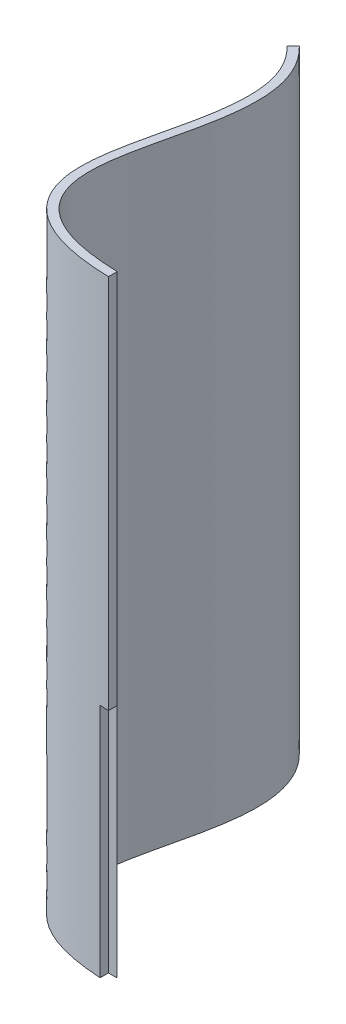
ISO-10303-21;
HEADER;
FILE_DESCRIPTION(('STEP AP214'),'2;1');
FILE_NAME('part.step','',(''),(''),'','','');
FILE_SCHEMA(('AUTOMOTIVE_DESIGN { 1 0 10303 214 1 1 1 1 }'));
ENDSEC;
DATA;
#1=APPLICATION_CONTEXT('core data for automotive mechanical design processes');
#2=APPLICATION_PROTOCOL_DEFINITION('international standard','automotive_design',2000,#1);
#3=PRODUCT_CONTEXT('',#1,'mechanical');
#4=PRODUCT('Part','Part','',(#3));
#5=PRODUCT_RELATED_PRODUCT_CATEGORY('part','',(#4));
#6=PRODUCT_DEFINITION_FORMATION('','',#4);
#7=PRODUCT_DEFINITION_CONTEXT('part definition',#1,'design');
#8=PRODUCT_DEFINITION('design','',#6,#7);
#9=PRODUCT_DEFINITION_SHAPE('','',#8);
#10=(LENGTH_UNIT() NAMED_UNIT(*) SI_UNIT(.MILLI.,.METRE.));
#11=(NAMED_UNIT(*) PLANE_ANGLE_UNIT() SI_UNIT($,.RADIAN.));
#12=(NAMED_UNIT(*) SI_UNIT($,.STERADIAN.) SOLID_ANGLE_UNIT());
#13=UNCERTAINTY_MEASURE_WITH_UNIT(LENGTH_MEASURE(1.E-05),#10,'distance_accuracy_value','');
#14=(GEOMETRIC_REPRESENTATION_CONTEXT(3) GLOBAL_UNCERTAINTY_ASSIGNED_CONTEXT((#13)) GLOBAL_UNIT_ASSIGNED_CONTEXT((#10,
#11,#12)) REPRESENTATION_CONTEXT('',''));
#15=CARTESIAN_POINT('',(0.,0.,0.));
#16=DIRECTION('',(0.,0.,1.));
#17=DIRECTION('',(1.,0.,0.));
#18=AXIS2_PLACEMENT_3D('',#15,#16,#17);
#19=CARTESIAN_POINT('',(-17.2891641517776,140.,73.7814617537538));
#20=DIRECTION('',(-1.,0.,0.));
#21=DIRECTION('',(0.,0.,1.));
#22=AXIS2_PLACEMENT_3D('',#19,#20,#21);
#23=PLANE('',#22);
#24=DIRECTION('',(0.,-1.,0.));
#25=VECTOR('',#24,1.);
#26=CARTESIAN_POINT('',(-17.2891641517776,140.,73.7814617537538));
#27=LINE('',#26,#25);
#28=CARTESIAN_POINT('',(-17.2891641517776,140.,73.7814617537538));
#29=VERTEX_POINT('',#28);
#30=CARTESIAN_POINT('',(-17.2891641517776,54.,73.7814617537538));
#31=VERTEX_POINT('',#30);
#32=EDGE_CURVE('E147',#29,#31,#27,.T.);
#33=ORIENTED_EDGE('',*,*,#32,.T.);
#34=DIRECTION('',(0.,0.,1.));
#35=VECTOR('',#34,1.);
#36=CARTESIAN_POINT('',(-17.2891641517776,54.,73.7814617537538));
#37=LINE('',#36,#35);
#38=CARTESIAN_POINT('',(-17.2891641517776,54.,71.7806098181427));
#39=VERTEX_POINT('',#38);
#40=EDGE_CURVE('E96',#39,#31,#37,.T.);
#41=ORIENTED_EDGE('',*,*,#40,.F.);
#42=DIRECTION('',(0.,1.,0.));
#43=VECTOR('',#42,1.);
#44=CARTESIAN_POINT('',(-17.2891641517776,0.,71.7806098181427));
#45=LINE('',#44,#43);
#46=CARTESIAN_POINT('',(-17.2891641517776,140.,71.7806098181427));
#47=VERTEX_POINT('',#46);
#48=EDGE_CURVE('E165',#39,#47,#45,.T.);
#49=ORIENTED_EDGE('',*,*,#48,.T.);
#50=DIRECTION('',(0.,0.,-1.));
#51=VECTOR('',#50,1.);
#52=CARTESIAN_POINT('',(-17.2891641517776,140.,73.7814617537538));
#53=LINE('',#52,#51);
#54=EDGE_CURVE('E150',#29,#47,#53,.T.);
#55=ORIENTED_EDGE('',*,*,#54,.F.);
#56=EDGE_LOOP('',(#33,#41,#49,#55));
#57=FACE_BOUND('',#56,.T.);
#58=ADVANCED_FACE('F33',(#57),#23,.F.);
#59=CARTESIAN_POINT('',(0.,140.,0.));
#60=DIRECTION('',(0.,-1.,0.));
#61=DIRECTION('',(0.,0.,-1.));
#62=AXIS2_PLACEMENT_3D('',#59,#60,#61);
#63=PLANE('',#62);
#64=CARTESIAN_POINT('',(-17.2316077522161,140.,71.7822901100799));
#65=CARTESIAN_POINT('',(-17.9507513573461,140.,71.761585876499));
#66=CARTESIAN_POINT('',(-19.4197648144313,140.,71.6974106149465));
#67=CARTESIAN_POINT('',(-21.4318342259687,140.,71.542554365795));
#68=CARTESIAN_POINT('',(-23.3392876734465,140.,71.3274441326271));
#69=CARTESIAN_POINT('',(-25.7133899654343,140.,70.9631351681575));
#70=CARTESIAN_POINT('',(-28.3949809966128,140.,70.3629259697974));
#71=CARTESIAN_POINT('',(-31.1719686335562,140.,69.419957516191));
#72=CARTESIAN_POINT('',(-33.55138532447,140.,68.2506702851788));
#73=CARTESIAN_POINT('',(-36.1874174246494,140.,66.4172463953082));
#74=CARTESIAN_POINT('',(-38.5723430465206,140.,63.5886610405637));
#75=CARTESIAN_POINT('',(-40.0583681992634,140.,59.5799779627924));
#76=CARTESIAN_POINT('',(-40.4614102624548,140.,55.1591168106173));
#77=CARTESIAN_POINT('',(-40.0811655029373,140.,50.3994853530163));
#78=CARTESIAN_POINT('',(-38.8734782348359,140.,43.7074771208055));
#79=CARTESIAN_POINT('',(-37.1010646929482,140.,36.6375900270869));
#80=CARTESIAN_POINT('',(-35.6963050640142,140.,29.5467325834782));
#81=CARTESIAN_POINT('',(-35.0550391735983,140.,24.3169376289286));
#82=CARTESIAN_POINT('',(-35.0472188052178,140.,19.281220811991));
#83=CARTESIAN_POINT('',(-35.7425238759612,140.,15.323177805859));
#84=CARTESIAN_POINT('',(-36.8209584853626,140.,12.3372950389621));
#85=CARTESIAN_POINT('',(-37.9183835723472,140.,10.191651315682));
#86=CARTESIAN_POINT('',(-39.0996459468037,140.,8.48499299150393));
#87=CARTESIAN_POINT('',(-40.2180554789664,140.,7.17364195510251));
#88=CARTESIAN_POINT('',(-40.8470515580946,140.,6.5277734551199));
#89=CARTESIAN_POINT('',(-41.1679712467012,140.,6.21884899924497));
#90=B_SPLINE_CURVE_WITH_KNOTS('',3,(#64,#65,#66,#67,#68,#69,#70,#71,#72,#73,#74,#75,#76,#77,#78,
#79,#80,#81,#82,#83,#84,#85,#86,#87,#88,#89),.UNSPECIFIED.,.F.,.F.,(4,1,1,1,1,1,1,1,1,1,1,1,1,1,
1,1,1,1,1,1,1,1,1,4),(0.,0.0152529294478035,0.030505858895607,0.0457587883434105,
0.061011717791214,0.091517576686821,0.122023435582428,0.152529294478035,0.183035153373642,
0.244046871164856,0.30505858895607,0.366070306747284,0.427082024538498,0.488093742329712,
0.61011717791214,0.671128895703354,0.732140613494568,0.793152331285782,0.854164049076996,
0.884669907972603,0.91517576686821,0.945681625763817,0.960934555211621,0.976187484659424),.UNSPECIFIED.);
#91=CARTESIAN_POINT('',(-41.1679712467012,140.,6.21884899924497));
#92=VERTEX_POINT('',#91);
#93=EDGE_CURVE('E109',#47,#92,#90,.T.);
#94=ORIENTED_EDGE('',*,*,#93,.T.);
#95=DIRECTION('',(0.693514341347727,0.,-0.720442821010126));
#96=VECTOR('',#95,1.);
#97=CARTESIAN_POINT('',(-18.2605659061376,140.,-17.5780283566095));
#98=LINE('',#97,#96);
#99=CARTESIAN_POINT('',(-42.5549999293967,140.,7.65973464126522));
#100=VERTEX_POINT('',#99);
#101=EDGE_CURVE('E117',#100,#92,#98,.T.);
#102=ORIENTED_EDGE('',*,*,#101,.F.);
#103=CARTESIAN_POINT('',(-17.2891641517776,140.,73.7814617537538));
#104=CARTESIAN_POINT('',(-18.0287907450115,140.,73.760167812405));
#105=CARTESIAN_POINT('',(-19.5367360392349,140.,73.6943343471407));
#106=CARTESIAN_POINT('',(-21.6192013775838,140.,73.5341984645637));
#107=CARTESIAN_POINT('',(-23.6002604196159,140.,73.3108658214682));
#108=CARTESIAN_POINT('',(-26.0853058320198,140.,72.929731587213));
#109=CARTESIAN_POINT('',(-28.9235540126041,140.,72.2957400914353));
#110=CARTESIAN_POINT('',(-31.9256168113243,140.,71.2784519467017));
#111=CARTESIAN_POINT('',(-34.5565915306844,140.,69.9884861678684));
#112=CARTESIAN_POINT('',(-37.5560205150353,140.,67.9075986961571));
#113=CARTESIAN_POINT('',(-40.3408508779942,140.,64.6106996604237));
#114=CARTESIAN_POINT('',(-42.0411410921327,140.,59.988281570211));
#115=CARTESIAN_POINT('',(-42.4699419800001,140.,55.1343895004107));
#116=CARTESIAN_POINT('',(-42.0642328985532,140.,50.1181657246556));
#117=CARTESIAN_POINT('',(-40.8213594475948,140.,43.2475980342387));
#118=CARTESIAN_POINT('',(-39.0462397917633,140.,36.1698478052927));
#119=CARTESIAN_POINT('',(-37.6703940814243,140.,29.2151752316938));
#120=CARTESIAN_POINT('',(-37.0543607960716,140.,24.1734528886082));
#121=CARTESIAN_POINT('',(-37.0519485901904,140.,19.4298142063623));
#122=CARTESIAN_POINT('',(-37.6927006607669,140.,15.8130139592587));
#123=CARTESIAN_POINT('',(-38.6615038668838,140.,13.1337023315595));
#124=CARTESIAN_POINT('',(-39.6387974148036,140.,11.2230520205787));
#125=CARTESIAN_POINT('',(-40.6935714035493,140.,9.69890671478233));
#126=CARTESIAN_POINT('',(-41.6952582823422,140.,8.5240551843907));
#127=CARTESIAN_POINT('',(-42.2650444698582,140.,7.93885223905048));
#128=CARTESIAN_POINT('',(-42.5549999293967,140.,7.65973464126522));
#129=B_SPLINE_CURVE_WITH_KNOTS('',3,(#103,#104,#105,#106,#107,#108,#109,#110,#111,#112,#113,
#114,#115,#116,#117,#118,#119,#120,#121,#122,#123,#124,#125,#126,#127,#128),.UNSPECIFIED.,.F.,
.F.,(4,1,1,1,1,1,1,1,1,1,1,1,1,1,1,1,1,1,1,1,1,1,1,4),(0.,0.0152529294478035,0.030505858895607,
0.0457587883434105,0.061011717791214,0.091517576686821,0.122023435582428,0.152529294478035,
0.183035153373642,0.244046871164856,0.30505858895607,0.366070306747284,0.427082024538498,
0.488093742329712,0.61011717791214,0.671128895703354,0.732140613494568,0.793152331285782,
0.854164049076996,0.884669907972603,0.91517576686821,0.945681625763817,0.960934555211621,
0.976187484659424),.UNSPECIFIED.);
#130=EDGE_CURVE('E181',#29,#100,#129,.T.);
#131=ORIENTED_EDGE('',*,*,#130,.F.);
#132=ORIENTED_EDGE('',*,*,#54,.T.);
#133=EDGE_LOOP('',(#94,#102,#131,#132));
#134=FACE_BOUND('',#133,.T.);
#135=ADVANCED_FACE('F134',(#134),#63,.F.);
#136=CARTESIAN_POINT('',(0.,0.,0.));
#137=DIRECTION('',(0.,-1.,0.));
#138=DIRECTION('',(0.,0.,-1.));
#139=AXIS2_PLACEMENT_3D('',#136,#137,#138);
#140=PLANE('',#139);
#141=DIRECTION('',(1.,0.,0.));
#142=VECTOR('',#141,1.);
#143=CARTESIAN_POINT('',(-19.2891641517776,0.,71.7806098181427));
#144=LINE('',#143,#142);
#145=CARTESIAN_POINT('',(-19.2891641517776,0.,71.7806098181427));
#146=VERTEX_POINT('',#145);
#147=CARTESIAN_POINT('',(-17.2891641517776,0.,71.7806098181427));
#148=VERTEX_POINT('',#147);
#149=EDGE_CURVE('E101',#146,#148,#144,.T.);
#150=ORIENTED_EDGE('',*,*,#149,.F.);
#151=DIRECTION('',(0.,0.,-1.));
#152=VECTOR('',#151,1.);
#153=CARTESIAN_POINT('',(-19.2891641517776,0.,71.7806098181427));
#154=LINE('',#153,#152);
#155=CARTESIAN_POINT('',(-19.2891641517776,0.,73.6967163464709));
#156=VERTEX_POINT('',#155);
#157=EDGE_CURVE('E90',#156,#146,#154,.T.);
#158=ORIENTED_EDGE('',*,*,#157,.F.);
#159=CARTESIAN_POINT('',(-17.2891641517776,0.,73.7814617537538));
#160=CARTESIAN_POINT('',(-18.0287907450115,0.,73.760167812405));
#161=CARTESIAN_POINT('',(-19.5367360392349,0.,73.6943343471407));
#162=CARTESIAN_POINT('',(-21.6192013775838,0.,73.5341984645637));
#163=CARTESIAN_POINT('',(-23.6002604196159,0.,73.3108658214682));
#164=CARTESIAN_POINT('',(-26.0853058320198,0.,72.929731587213));
#165=CARTESIAN_POINT('',(-28.9235540126041,0.,72.2957400914353));
#166=CARTESIAN_POINT('',(-31.9256168113243,0.,71.2784519467017));
#167=CARTESIAN_POINT('',(-34.5565915306844,0.,69.9884861678684));
#168=CARTESIAN_POINT('',(-37.5560205150353,0.,67.9075986961571));
#169=CARTESIAN_POINT('',(-40.3408508779942,0.,64.6106996604237));
#170=CARTESIAN_POINT('',(-42.0411410921327,0.,59.988281570211));
#171=CARTESIAN_POINT('',(-42.4699419800001,0.,55.1343895004107));
#172=CARTESIAN_POINT('',(-42.0642328985532,0.,50.1181657246556));
#173=CARTESIAN_POINT('',(-40.8213594475948,0.,43.2475980342387));
#174=CARTESIAN_POINT('',(-39.0462397917633,0.,36.1698478052927));
#175=CARTESIAN_POINT('',(-37.6703940814243,0.,29.2151752316938));
#176=CARTESIAN_POINT('',(-37.0543607960716,0.,24.1734528886082));
#177=CARTESIAN_POINT('',(-37.0519485901904,0.,19.4298142063623));
#178=CARTESIAN_POINT('',(-37.6927006607669,0.,15.8130139592587));
#179=CARTESIAN_POINT('',(-38.6615038668838,0.,13.1337023315595));
#180=CARTESIAN_POINT('',(-39.6387974148036,0.,11.2230520205787));
#181=CARTESIAN_POINT('',(-40.6935714035493,0.,9.69890671478233));
#182=CARTESIAN_POINT('',(-41.6952582823422,0.,8.5240551843907));
#183=CARTESIAN_POINT('',(-42.2650444698582,0.,7.93885223905048));
#184=CARTESIAN_POINT('',(-42.5549999293967,0.,7.65973464126522));
#185=B_SPLINE_CURVE_WITH_KNOTS('',3,(#159,#160,#161,#162,#163,#164,#165,#166,#167,#168,#169,
#170,#171,#172,#173,#174,#175,#176,#177,#178,#179,#180,#181,#182,#183,#184),.UNSPECIFIED.,.F.,
.F.,(4,1,1,1,1,1,1,1,1,1,1,1,1,1,1,1,1,1,1,1,1,1,1,4),(0.,0.0152529294478035,0.030505858895607,
0.0457587883434105,0.061011717791214,0.091517576686821,0.122023435582428,0.152529294478035,
0.183035153373642,0.244046871164856,0.30505858895607,0.366070306747284,0.427082024538498,
0.488093742329712,0.61011717791214,0.671128895703354,0.732140613494568,0.793152331285782,
0.854164049076996,0.884669907972603,0.91517576686821,0.945681625763817,0.960934555211621,
0.976187484659424),.UNSPECIFIED.);
#186=CARTESIAN_POINT('',(-42.5549999293967,0.,7.65973464126522));
#187=VERTEX_POINT('',#186);
#188=EDGE_CURVE('E57',#156,#187,#185,.T.);
#189=ORIENTED_EDGE('',*,*,#188,.T.);
#190=DIRECTION('',(0.693514341347727,0.,-0.720442821010126));
#191=VECTOR('',#190,1.);
#192=CARTESIAN_POINT('',(-18.2605659061376,0.,-17.5780283566095));
#193=LINE('',#192,#191);
#194=CARTESIAN_POINT('',(-41.1679712467012,0.,6.21884899924497));
#195=VERTEX_POINT('',#194);
#196=EDGE_CURVE('E172',#187,#195,#193,.T.);
#197=ORIENTED_EDGE('',*,*,#196,.T.);
#198=CARTESIAN_POINT('',(-17.2316077522161,0.,71.7822901100799));
#199=CARTESIAN_POINT('',(-17.9507513573461,0.,71.761585876499));
#200=CARTESIAN_POINT('',(-19.4197648144313,0.,71.6974106149465));
#201=CARTESIAN_POINT('',(-21.4318342259687,0.,71.542554365795));
#202=CARTESIAN_POINT('',(-23.3392876734465,0.,71.3274441326271));
#203=CARTESIAN_POINT('',(-25.7133899654343,0.,70.9631351681575));
#204=CARTESIAN_POINT('',(-28.3949809966128,0.,70.3629259697974));
#205=CARTESIAN_POINT('',(-31.1719686335562,0.,69.419957516191));
#206=CARTESIAN_POINT('',(-33.55138532447,0.,68.2506702851788));
#207=CARTESIAN_POINT('',(-36.1874174246494,0.,66.4172463953082));
#208=CARTESIAN_POINT('',(-38.5723430465206,0.,63.5886610405637));
#209=CARTESIAN_POINT('',(-40.0583681992634,0.,59.5799779627924));
#210=CARTESIAN_POINT('',(-40.4614102624548,0.,55.1591168106173));
#211=CARTESIAN_POINT('',(-40.0811655029373,0.,50.3994853530163));
#212=CARTESIAN_POINT('',(-38.8734782348359,0.,43.7074771208055));
#213=CARTESIAN_POINT('',(-37.1010646929482,0.,36.6375900270869));
#214=CARTESIAN_POINT('',(-35.6963050640142,0.,29.5467325834782));
#215=CARTESIAN_POINT('',(-35.0550391735983,0.,24.3169376289286));
#216=CARTESIAN_POINT('',(-35.0472188052178,0.,19.281220811991));
#217=CARTESIAN_POINT('',(-35.7425238759612,0.,15.323177805859));
#218=CARTESIAN_POINT('',(-36.8209584853626,0.,12.3372950389621));
#219=CARTESIAN_POINT('',(-37.9183835723472,0.,10.191651315682));
#220=CARTESIAN_POINT('',(-39.0996459468037,0.,8.48499299150393));
#221=CARTESIAN_POINT('',(-40.2180554789664,0.,7.17364195510251));
#222=CARTESIAN_POINT('',(-40.8470515580946,0.,6.5277734551199));
#223=CARTESIAN_POINT('',(-41.1679712467012,0.,6.21884899924497));
#224=B_SPLINE_CURVE_WITH_KNOTS('',3,(#198,#199,#200,#201,#202,#203,#204,#205,#206,#207,#208,
#209,#210,#211,#212,#213,#214,#215,#216,#217,#218,#219,#220,#221,#222,#223),.UNSPECIFIED.,.F.,
.F.,(4,1,1,1,1,1,1,1,1,1,1,1,1,1,1,1,1,1,1,1,1,1,1,4),(0.,0.0152529294478035,0.030505858895607,
0.0457587883434105,0.061011717791214,0.091517576686821,0.122023435582428,0.152529294478035,
0.183035153373642,0.244046871164856,0.30505858895607,0.366070306747284,0.427082024538498,
0.488093742329712,0.61011717791214,0.671128895703354,0.732140613494568,0.793152331285782,
0.854164049076996,0.884669907972603,0.91517576686821,0.945681625763817,0.960934555211621,
0.976187484659424),.UNSPECIFIED.);
#225=EDGE_CURVE('E107',#148,#195,#224,.T.);
#226=ORIENTED_EDGE('',*,*,#225,.F.);
#227=EDGE_LOOP('',(#150,#158,#189,#197,#226));
#228=FACE_BOUND('',#227,.T.);
#229=ADVANCED_FACE('F106',(#228),#140,.T.);
#230=DIRECTION('',(0.,1.,0.));
#231=VECTOR('',#230,1.);
#232=SURFACE_OF_LINEAR_EXTRUSION('',#224,#231);
#233=ORIENTED_EDGE('',*,*,#93,.F.);
#234=ORIENTED_EDGE('',*,*,#48,.F.);
#235=EDGE_CURVE('E171',#148,#39,#45,.T.);
#236=ORIENTED_EDGE('',*,*,#235,.F.);
#237=ORIENTED_EDGE('',*,*,#225,.T.);
#238=DIRECTION('',(0.,1.,0.));
#239=VECTOR('',#238,1.);
#240=CARTESIAN_POINT('',(-41.1679712467012,0.,6.21884899924497));
#241=LINE('',#240,#239);
#242=EDGE_CURVE('E156',#195,#92,#241,.T.);
#243=ORIENTED_EDGE('',*,*,#242,.T.);
#244=EDGE_LOOP('',(#233,#234,#236,#237,#243));
#245=FACE_BOUND('',#244,.T.);
#246=ADVANCED_FACE('F126',(#245),#232,.T.);
#247=CARTESIAN_POINT('',(-18.2605659061376,0.,-17.5780283566095));
#248=DIRECTION('',(0.720442821010126,0.,0.693514341347727));
#249=DIRECTION('',(0.693514341347727,0.,-0.720442821010126));
#250=AXIS2_PLACEMENT_3D('',#247,#248,#249);
#251=PLANE('',#250);
#252=ORIENTED_EDGE('',*,*,#101,.T.);
#253=ORIENTED_EDGE('',*,*,#242,.F.);
#254=ORIENTED_EDGE('',*,*,#196,.F.);
#255=DIRECTION('',(0.,1.,0.));
#256=VECTOR('',#255,1.);
#257=CARTESIAN_POINT('',(-42.5549999293967,0.,7.65973464126522));
#258=LINE('',#257,#256);
#259=EDGE_CURVE('E175',#187,#100,#258,.T.);
#260=ORIENTED_EDGE('',*,*,#259,.T.);
#261=EDGE_LOOP('',(#252,#253,#254,#260));
#262=FACE_BOUND('',#261,.T.);
#263=ADVANCED_FACE('F130',(#262),#251,.F.);
#264=DIRECTION('',(0.,1.,0.));
#265=VECTOR('',#264,1.);
#266=SURFACE_OF_LINEAR_EXTRUSION('',#185,#265);
#267=DIRECTION('',(0.,1.,0.));
#268=VECTOR('',#267,1.);
#269=CARTESIAN_POINT('',(-19.2891641517776,0.,73.6967163464709));
#270=LINE('',#269,#268);
#271=CARTESIAN_POINT('',(-19.2891641517776,54.,73.6967163464709));
#272=VERTEX_POINT('',#271);
#273=EDGE_CURVE('E41',#156,#272,#270,.T.);
#274=ORIENTED_EDGE('',*,*,#273,.T.);
#275=CARTESIAN_POINT('',(-17.2891641517776,54.,73.7814617537538));
#276=CARTESIAN_POINT('',(-18.0287907450115,54.,73.760167812405));
#277=CARTESIAN_POINT('',(-19.5367360392349,54.,73.6943343471407));
#278=CARTESIAN_POINT('',(-21.6192013775838,54.,73.5341984645637));
#279=CARTESIAN_POINT('',(-23.6002604196159,54.,73.3108658214682));
#280=CARTESIAN_POINT('',(-26.0853058320198,54.,72.929731587213));
#281=CARTESIAN_POINT('',(-28.9235540126041,54.,72.2957400914353));
#282=CARTESIAN_POINT('',(-31.9256168113243,54.,71.2784519467017));
#283=CARTESIAN_POINT('',(-34.5565915306844,54.,69.9884861678684));
#284=CARTESIAN_POINT('',(-37.5560205150353,54.,67.9075986961571));
#285=CARTESIAN_POINT('',(-40.3408508779942,54.,64.6106996604237));
#286=CARTESIAN_POINT('',(-42.0411410921327,54.,59.988281570211));
#287=CARTESIAN_POINT('',(-42.4699419800001,54.,55.1343895004107));
#288=CARTESIAN_POINT('',(-42.0642328985532,54.,50.1181657246556));
#289=CARTESIAN_POINT('',(-40.8213594475948,54.,43.2475980342387));
#290=CARTESIAN_POINT('',(-39.0462397917633,54.,36.1698478052927));
#291=CARTESIAN_POINT('',(-37.6703940814243,54.,29.2151752316938));
#292=CARTESIAN_POINT('',(-37.0543607960716,54.,24.1734528886082));
#293=CARTESIAN_POINT('',(-37.0519485901904,54.,19.4298142063623));
#294=CARTESIAN_POINT('',(-37.6927006607669,54.,15.8130139592587));
#295=CARTESIAN_POINT('',(-38.6615038668838,54.,13.1337023315595));
#296=CARTESIAN_POINT('',(-39.6387974148036,54.,11.2230520205787));
#297=CARTESIAN_POINT('',(-40.6935714035493,54.,9.69890671478233));
#298=CARTESIAN_POINT('',(-41.6952582823422,54.,8.5240551843907));
#299=CARTESIAN_POINT('',(-42.2650444698582,54.,7.93885223905048));
#300=CARTESIAN_POINT('',(-42.5549999293967,54.,7.65973464126522));
#301=B_SPLINE_CURVE_WITH_KNOTS('',3,(#275,#276,#277,#278,#279,#280,#281,#282,#283,#284,#285,
#286,#287,#288,#289,#290,#291,#292,#293,#294,#295,#296,#297,#298,#299,#300),.UNSPECIFIED.,.F.,
.F.,(4,1,1,1,1,1,1,1,1,1,1,1,1,1,1,1,1,1,1,1,1,1,1,4),(0.,0.0152529294478035,0.030505858895607,
0.0457587883434105,0.061011717791214,0.091517576686821,0.122023435582428,0.152529294478035,
0.183035153373642,0.244046871164856,0.30505858895607,0.366070306747284,0.427082024538498,
0.488093742329712,0.61011717791214,0.671128895703354,0.732140613494568,0.793152331285782,
0.854164049076996,0.884669907972603,0.91517576686821,0.945681625763817,0.960934555211621,
0.976187484659424),.UNSPECIFIED.);
#302=EDGE_CURVE('E11',#272,#31,#301,.F.);
#303=ORIENTED_EDGE('',*,*,#302,.T.);
#304=ORIENTED_EDGE('',*,*,#32,.F.);
#305=ORIENTED_EDGE('',*,*,#130,.T.);
#306=ORIENTED_EDGE('',*,*,#259,.F.);
#307=ORIENTED_EDGE('',*,*,#188,.F.);
#308=EDGE_LOOP('',(#274,#303,#304,#305,#306,#307));
#309=FACE_BOUND('',#308,.T.);
#310=ADVANCED_FACE('F132',(#309),#266,.F.);
#311=CARTESIAN_POINT('',(-19.2891641517776,54.,73.7814617537538));
#312=DIRECTION('',(0.,1.,0.));
#313=DIRECTION('',(0.,0.,1.));
#314=AXIS2_PLACEMENT_3D('',#311,#312,#313);
#315=PLANE('',#314);
#316=DIRECTION('',(0.,0.,1.));
#317=VECTOR('',#316,1.);
#318=CARTESIAN_POINT('',(-19.2891641517776,54.,73.7814617537538));
#319=LINE('',#318,#317);
#320=CARTESIAN_POINT('',(-19.2891641517776,54.,71.7806098181427));
#321=VERTEX_POINT('',#320);
#322=EDGE_CURVE('E49',#321,#272,#319,.T.);
#323=ORIENTED_EDGE('',*,*,#322,.F.);
#324=DIRECTION('',(1.,0.,0.));
#325=VECTOR('',#324,1.);
#326=CARTESIAN_POINT('',(-19.2891641517776,54.,71.7806098181427));
#327=LINE('',#326,#325);
#328=EDGE_CURVE('E103',#321,#39,#327,.T.);
#329=ORIENTED_EDGE('',*,*,#328,.T.);
#330=ORIENTED_EDGE('',*,*,#40,.T.);
#331=ORIENTED_EDGE('',*,*,#302,.F.);
#332=EDGE_LOOP('',(#323,#329,#330,#331));
#333=FACE_BOUND('',#332,.T.);
#334=ADVANCED_FACE('F200',(#333),#315,.F.);
#335=CARTESIAN_POINT('',(-19.2891641517776,0.,0.));
#336=DIRECTION('',(-1.,0.,0.));
#337=DIRECTION('',(0.,0.,1.));
#338=AXIS2_PLACEMENT_3D('',#335,#336,#337);
#339=PLANE('',#338);
#340=ORIENTED_EDGE('',*,*,#157,.T.);
#341=DIRECTION('',(0.,1.,0.));
#342=VECTOR('',#341,1.);
#343=CARTESIAN_POINT('',(-19.2891641517776,54.,71.7806098181427));
#344=LINE('',#343,#342);
#345=EDGE_CURVE('E93',#146,#321,#344,.T.);
#346=ORIENTED_EDGE('',*,*,#345,.T.);
#347=ORIENTED_EDGE('',*,*,#322,.T.);
#348=ORIENTED_EDGE('',*,*,#273,.F.);
#349=EDGE_LOOP('',(#340,#346,#347,#348));
#350=FACE_BOUND('',#349,.T.);
#351=ADVANCED_FACE('F92',(#350),#339,.F.);
#352=CARTESIAN_POINT('',(-19.2891641517776,54.,71.7806098181427));
#353=DIRECTION('',(0.,0.,-1.));
#354=DIRECTION('',(-1.,0.,0.));
#355=AXIS2_PLACEMENT_3D('',#352,#353,#354);
#356=PLANE('',#355);
#357=ORIENTED_EDGE('',*,*,#235,.T.);
#358=ORIENTED_EDGE('',*,*,#328,.F.);
#359=ORIENTED_EDGE('',*,*,#345,.F.);
#360=ORIENTED_EDGE('',*,*,#149,.T.);
#361=EDGE_LOOP('',(#357,#358,#359,#360));
#362=FACE_BOUND('',#361,.T.);
#363=ADVANCED_FACE('F100',(#362),#356,.F.);
#364=CLOSED_SHELL('',(#58,#135,#229,#246,#263,#310,#334,#351,#363));
#365=MANIFOLD_SOLID_BREP('B2',#364);
#366=ADVANCED_BREP_SHAPE_REPRESENTATION('',(#18,#365),#14);
#367=SHAPE_DEFINITION_REPRESENTATION(#9,#366);
ENDSEC;
END-ISO-10303-21;
